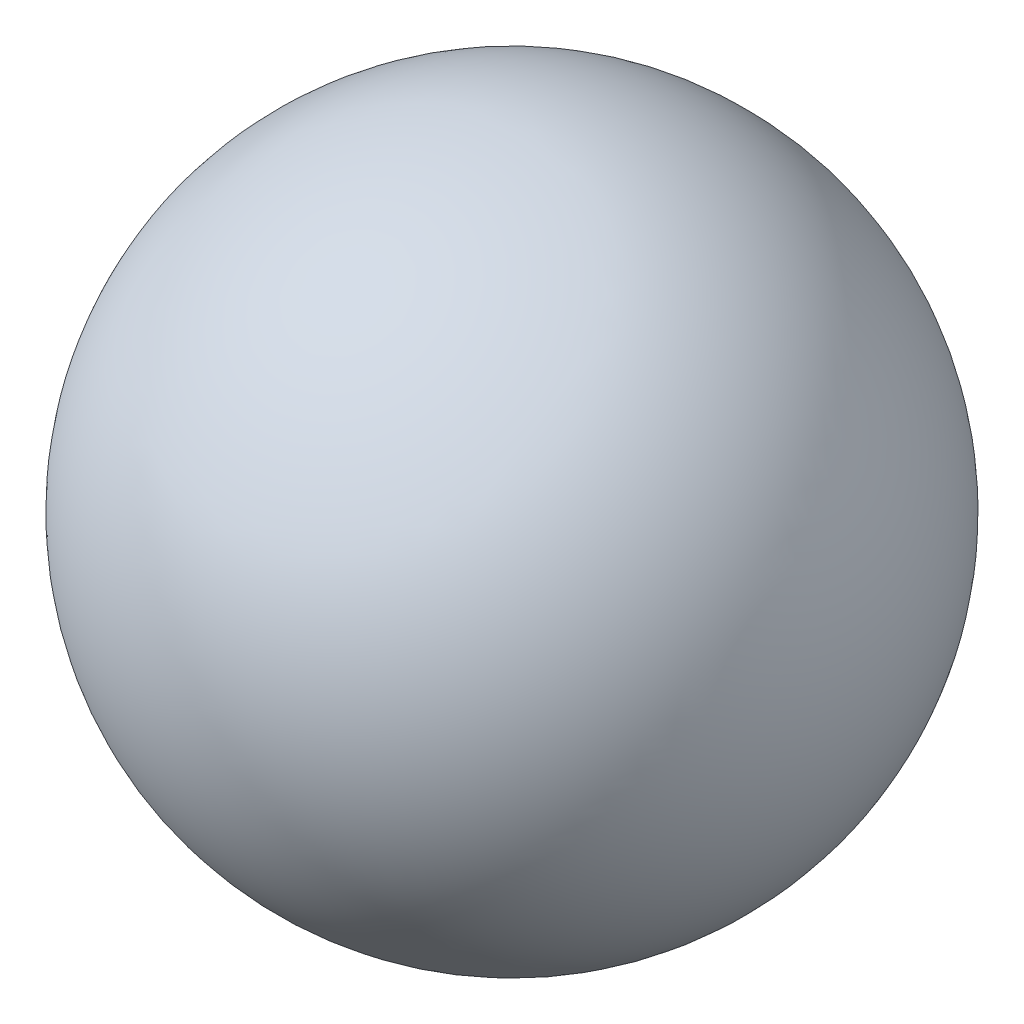
ISO-10303-21;
HEADER;
FILE_DESCRIPTION(('STEP AP214'),'2;1');
FILE_NAME('part.step','',(''),(''),'','','');
FILE_SCHEMA(('AUTOMOTIVE_DESIGN { 1 0 10303 214 1 1 1 1 }'));
ENDSEC;
DATA;
#1=APPLICATION_CONTEXT('core data for automotive mechanical design processes');
#2=APPLICATION_PROTOCOL_DEFINITION('international standard','automotive_design',2000,#1);
#3=PRODUCT_CONTEXT('',#1,'mechanical');
#4=PRODUCT('Part','Part','',(#3));
#5=PRODUCT_RELATED_PRODUCT_CATEGORY('part','',(#4));
#6=PRODUCT_DEFINITION_FORMATION('','',#4);
#7=PRODUCT_DEFINITION_CONTEXT('part definition',#1,'design');
#8=PRODUCT_DEFINITION('design','',#6,#7);
#9=PRODUCT_DEFINITION_SHAPE('','',#8);
#10=(LENGTH_UNIT() NAMED_UNIT(*) SI_UNIT(.MILLI.,.METRE.));
#11=(NAMED_UNIT(*) PLANE_ANGLE_UNIT() SI_UNIT($,.RADIAN.));
#12=(NAMED_UNIT(*) SI_UNIT($,.STERADIAN.) SOLID_ANGLE_UNIT());
#13=UNCERTAINTY_MEASURE_WITH_UNIT(LENGTH_MEASURE(1.E-05),#10,'distance_accuracy_value','');
#14=(GEOMETRIC_REPRESENTATION_CONTEXT(3) GLOBAL_UNCERTAINTY_ASSIGNED_CONTEXT((#13)) GLOBAL_UNIT_ASSIGNED_CONTEXT((#10,
#11,#12)) REPRESENTATION_CONTEXT('',''));
#15=CARTESIAN_POINT('',(0.,0.,0.));
#16=DIRECTION('',(0.,0.,1.));
#17=DIRECTION('',(1.,0.,0.));
#18=AXIS2_PLACEMENT_3D('',#15,#16,#17);
#19=CARTESIAN_POINT('',(0.5,1.,0.));
#20=DIRECTION('',(-1.,0.,0.));
#21=DIRECTION('',(0.,1.,0.));
#22=AXIS2_PLACEMENT_3D('',#19,#20,#21);
#23=SPHERICAL_SURFACE('',#22,0.3);
#24=CARTESIAN_POINT('',(0.2,1.,0.));
#25=VERTEX_POINT('',#24);
#26=VERTEX_LOOP('',#25);
#27=FACE_BOUND('',#26,.T.);
#28=ADVANCED_FACE('F29',(#27),#23,.T.);
#29=CLOSED_SHELL('',(#28));
#30=MANIFOLD_SOLID_BREP('B2',#29);
#31=ADVANCED_BREP_SHAPE_REPRESENTATION('',(#18,#30),#14);
#32=SHAPE_DEFINITION_REPRESENTATION(#9,#31);
ENDSEC;
END-ISO-10303-21;
